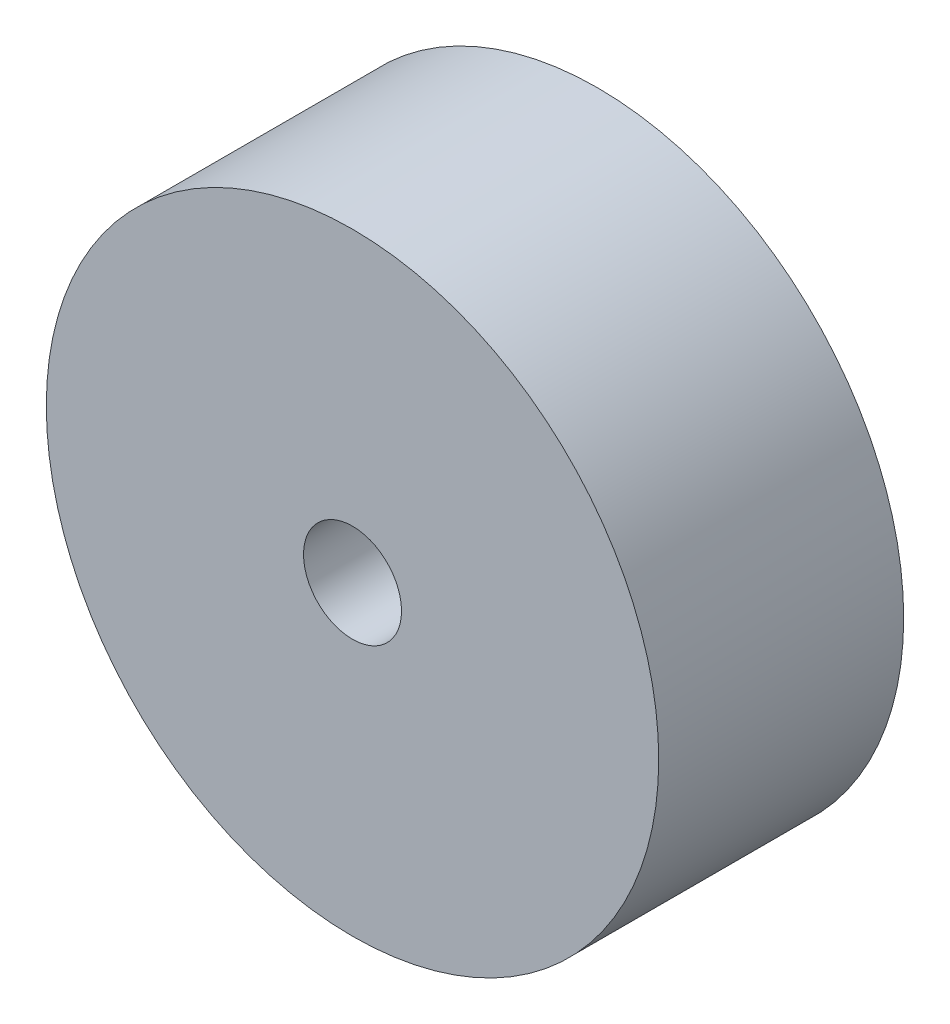
ISO-10303-21;
HEADER;
FILE_DESCRIPTION(('STEP AP214'),'2;1');
FILE_NAME('part.step','',(''),(''),'','','');
FILE_SCHEMA(('AUTOMOTIVE_DESIGN { 1 0 10303 214 1 1 1 1 }'));
ENDSEC;
DATA;
#1=APPLICATION_CONTEXT('core data for automotive mechanical design processes');
#2=APPLICATION_PROTOCOL_DEFINITION('international standard','automotive_design',2000,#1);
#3=PRODUCT_CONTEXT('',#1,'mechanical');
#4=PRODUCT('Part','Part','',(#3));
#5=PRODUCT_RELATED_PRODUCT_CATEGORY('part','',(#4));
#6=PRODUCT_DEFINITION_FORMATION('','',#4);
#7=PRODUCT_DEFINITION_CONTEXT('part definition',#1,'design');
#8=PRODUCT_DEFINITION('design','',#6,#7);
#9=PRODUCT_DEFINITION_SHAPE('','',#8);
#10=(LENGTH_UNIT() NAMED_UNIT(*) SI_UNIT(.MILLI.,.METRE.));
#11=(NAMED_UNIT(*) PLANE_ANGLE_UNIT() SI_UNIT($,.RADIAN.));
#12=(NAMED_UNIT(*) SI_UNIT($,.STERADIAN.) SOLID_ANGLE_UNIT());
#13=UNCERTAINTY_MEASURE_WITH_UNIT(LENGTH_MEASURE(1.E-05),#10,'distance_accuracy_value','');
#14=(GEOMETRIC_REPRESENTATION_CONTEXT(3) GLOBAL_UNCERTAINTY_ASSIGNED_CONTEXT((#13)) GLOBAL_UNIT_ASSIGNED_CONTEXT((#10,
#11,#12)) REPRESENTATION_CONTEXT('',''));
#15=CARTESIAN_POINT('',(0.,0.,0.));
#16=DIRECTION('',(0.,0.,1.));
#17=DIRECTION('',(1.,0.,0.));
#18=AXIS2_PLACEMENT_3D('',#15,#16,#17);
#19=CARTESIAN_POINT('',(0.,0.,0.));
#20=DIRECTION('',(0.,0.,1.));
#21=DIRECTION('',(1.,0.,0.));
#22=AXIS2_PLACEMENT_3D('',#19,#20,#21);
#23=PLANE('',#22);
#24=CARTESIAN_POINT('',(0.,0.,0.));
#25=DIRECTION('',(0.,0.,1.));
#26=DIRECTION('',(1.,0.,0.));
#27=AXIS2_PLACEMENT_3D('',#24,#25,#26);
#28=CIRCLE('',#27,0.625);
#29=CARTESIAN_POINT('',(0.625,0.,0.));
#30=VERTEX_POINT('',#29);
#31=EDGE_CURVE('E51',#30,#30,#28,.T.);
#32=ORIENTED_EDGE('',*,*,#31,.F.);
#33=EDGE_LOOP('',(#32));
#34=FACE_BOUND('',#33,.T.);
#35=CARTESIAN_POINT('',(0.,0.,0.));
#36=DIRECTION('',(0.,0.,-1.));
#37=DIRECTION('',(-1.,0.,0.));
#38=AXIS2_PLACEMENT_3D('',#35,#36,#37);
#39=CIRCLE('',#38,0.279508497187474);
#40=CARTESIAN_POINT('',(-0.279508497187474,0.,0.));
#41=VERTEX_POINT('',#40);
#42=EDGE_CURVE('E59',#41,#41,#39,.T.);
#43=ORIENTED_EDGE('',*,*,#42,.F.);
#44=EDGE_LOOP('',(#43));
#45=FACE_BOUND('',#44,.T.);
#46=ADVANCED_FACE('F36',(#34,#45),#23,.F.);
#47=CARTESIAN_POINT('',(0.,0.,0.5));
#48=DIRECTION('',(0.,0.,-1.));
#49=DIRECTION('',(-1.,0.,0.));
#50=AXIS2_PLACEMENT_3D('',#47,#48,#49);
#51=CYLINDRICAL_SURFACE('',#50,0.1);
#52=CARTESIAN_POINT('',(0.,0.,0.211654632815485));
#53=DIRECTION('',(0.,0.,-1.));
#54=DIRECTION('',(-1.,0.,0.));
#55=AXIS2_PLACEMENT_3D('',#52,#53,#54);
#56=CIRCLE('',#55,0.1);
#57=CARTESIAN_POINT('',(-0.1,0.,0.211654632815485));
#58=VERTEX_POINT('',#57);
#59=EDGE_CURVE('E43',#58,#58,#56,.T.);
#60=ORIENTED_EDGE('',*,*,#59,.T.);
#61=EDGE_LOOP('',(#60));
#62=FACE_BOUND('',#61,.T.);
#63=CARTESIAN_POINT('',(0.,0.,0.5));
#64=DIRECTION('',(0.,0.,1.));
#65=DIRECTION('',(1.,0.,0.));
#66=AXIS2_PLACEMENT_3D('',#63,#64,#65);
#67=CIRCLE('',#66,0.1);
#68=CARTESIAN_POINT('',(0.1,0.,0.5));
#69=VERTEX_POINT('',#68);
#70=EDGE_CURVE('E55',#69,#69,#67,.T.);
#71=ORIENTED_EDGE('',*,*,#70,.T.);
#72=EDGE_LOOP('',(#71));
#73=FACE_BOUND('',#72,.T.);
#74=ADVANCED_FACE('F66',(#62,#73),#51,.F.);
#75=CARTESIAN_POINT('',(0.,0.,0.5));
#76=DIRECTION('',(0.,0.,1.));
#77=DIRECTION('',(1.,0.,0.));
#78=AXIS2_PLACEMENT_3D('',#75,#76,#77);
#79=PLANE('',#78);
#80=CARTESIAN_POINT('',(0.,0.,0.5));
#81=DIRECTION('',(0.,0.,1.));
#82=DIRECTION('',(1.,0.,0.));
#83=AXIS2_PLACEMENT_3D('',#80,#81,#82);
#84=CIRCLE('',#83,0.625);
#85=CARTESIAN_POINT('',(0.625,0.,0.5));
#86=VERTEX_POINT('',#85);
#87=EDGE_CURVE('E47',#86,#86,#84,.T.);
#88=ORIENTED_EDGE('',*,*,#87,.T.);
#89=EDGE_LOOP('',(#88));
#90=FACE_BOUND('',#89,.T.);
#91=ORIENTED_EDGE('',*,*,#70,.F.);
#92=EDGE_LOOP('',(#91));
#93=FACE_BOUND('',#92,.T.);
#94=ADVANCED_FACE('F72',(#90,#93),#79,.T.);
#95=CARTESIAN_POINT('',(0.,0.,0.5));
#96=DIRECTION('',(0.,0.,-1.));
#97=DIRECTION('',(-1.,0.,0.));
#98=AXIS2_PLACEMENT_3D('',#95,#96,#97);
#99=CYLINDRICAL_SURFACE('',#98,0.625);
#100=ORIENTED_EDGE('',*,*,#87,.F.);
#101=EDGE_LOOP('',(#100));
#102=FACE_BOUND('',#101,.T.);
#103=ORIENTED_EDGE('',*,*,#31,.T.);
#104=EDGE_LOOP('',(#103));
#105=FACE_BOUND('',#104,.T.);
#106=ADVANCED_FACE('F76',(#102,#105),#99,.T.);
#107=CARTESIAN_POINT('',(0.,0.,-0.25));
#108=DIRECTION('',(0.,0.,-1.));
#109=DIRECTION('',(1.,0.,0.));
#110=AXIS2_PLACEMENT_3D('',#107,#108,#109);
#111=SPHERICAL_SURFACE('',#110,0.375);
#112=CARTESIAN_POINT('',(0.,0.,0.0797533091539176));
#113=DIRECTION('',(0.,0.,-1.));
#114=DIRECTION('',(-1.,0.,0.));
#115=AXIS2_PLACEMENT_3D('',#112,#113,#114);
#116=CIRCLE('',#115,0.178571428571429);
#117=CARTESIAN_POINT('',(-0.178571428571429,0.,0.0797533091539176));
#118=VERTEX_POINT('',#117);
#119=EDGE_CURVE('E10',#118,#118,#116,.F.);
#120=ORIENTED_EDGE('',*,*,#119,.T.);
#121=EDGE_LOOP('',(#120));
#122=FACE_BOUND('',#121,.T.);
#123=ORIENTED_EDGE('',*,*,#42,.T.);
#124=EDGE_LOOP('',(#123));
#125=FACE_BOUND('',#124,.T.);
#126=ADVANCED_FACE('F63',(#122,#125),#111,.F.);
#127=CARTESIAN_POINT('',(0.,0.,0.211654632815485));
#128=DIRECTION('',(0.,0.,-1.));
#129=DIRECTION('',(-1.,0.,0.));
#130=AXIS2_PLACEMENT_3D('',#127,#128,#129);
#131=TOROIDAL_SURFACE('',#130,0.25,0.15);
#132=ORIENTED_EDGE('',*,*,#119,.F.);
#133=EDGE_LOOP('',(#132));
#134=FACE_BOUND('',#133,.T.);
#135=ORIENTED_EDGE('',*,*,#59,.F.);
#136=EDGE_LOOP('',(#135));
#137=FACE_BOUND('',#136,.T.);
#138=ADVANCED_FACE('F38',(#134,#137),#131,.T.);
#139=CLOSED_SHELL('',(#46,#74,#94,#106,#126,#138));
#140=MANIFOLD_SOLID_BREP('B2',#139);
#141=ADVANCED_BREP_SHAPE_REPRESENTATION('',(#18,#140),#14);
#142=SHAPE_DEFINITION_REPRESENTATION(#9,#141);
ENDSEC;
END-ISO-10303-21;
